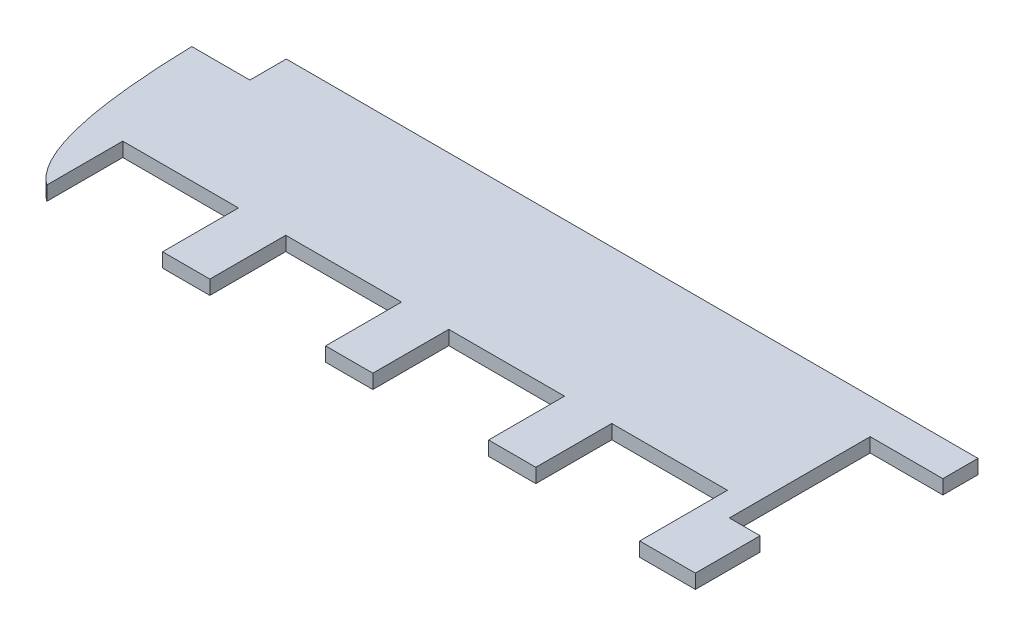
ISO-10303-21;
HEADER;
FILE_DESCRIPTION(('STEP AP214'),'2;1');
FILE_NAME('part.step','',(''),(''),'','','');
FILE_SCHEMA(('AUTOMOTIVE_DESIGN { 1 0 10303 214 1 1 1 1 }'));
ENDSEC;
DATA;
#1=APPLICATION_CONTEXT('core data for automotive mechanical design processes');
#2=APPLICATION_PROTOCOL_DEFINITION('international standard','automotive_design',2000,#1);
#3=PRODUCT_CONTEXT('',#1,'mechanical');
#4=PRODUCT('Part','Part','',(#3));
#5=PRODUCT_RELATED_PRODUCT_CATEGORY('part','',(#4));
#6=PRODUCT_DEFINITION_FORMATION('','',#4);
#7=PRODUCT_DEFINITION_CONTEXT('part definition',#1,'design');
#8=PRODUCT_DEFINITION('design','',#6,#7);
#9=PRODUCT_DEFINITION_SHAPE('','',#8);
#10=(LENGTH_UNIT() NAMED_UNIT(*) SI_UNIT(.MILLI.,.METRE.));
#11=(NAMED_UNIT(*) PLANE_ANGLE_UNIT() SI_UNIT($,.RADIAN.));
#12=(NAMED_UNIT(*) SI_UNIT($,.STERADIAN.) SOLID_ANGLE_UNIT());
#13=UNCERTAINTY_MEASURE_WITH_UNIT(LENGTH_MEASURE(1.E-05),#10,'distance_accuracy_value','');
#14=(GEOMETRIC_REPRESENTATION_CONTEXT(3) GLOBAL_UNCERTAINTY_ASSIGNED_CONTEXT((#13)) GLOBAL_UNIT_ASSIGNED_CONTEXT((#10,
#11,#12)) REPRESENTATION_CONTEXT('',''));
#15=CARTESIAN_POINT('',(0.,0.,0.));
#16=DIRECTION('',(0.,0.,1.));
#17=DIRECTION('',(1.,0.,0.));
#18=AXIS2_PLACEMENT_3D('',#15,#16,#17);
#19=CARTESIAN_POINT('',(-23.2479108635098,1.6,-15.8012256267409));
#20=DIRECTION('',(1.,0.,0.));
#21=DIRECTION('',(0.,0.,-1.));
#22=AXIS2_PLACEMENT_3D('',#19,#20,#21);
#23=PLANE('',#22);
#24=DIRECTION('',(0.,0.,1.));
#25=VECTOR('',#24,1.);
#26=CARTESIAN_POINT('',(-23.2479108635098,0.,-15.8012256267409));
#27=LINE('',#26,#25);
#28=CARTESIAN_POINT('',(-23.2479108635098,0.,-15.8012256267409));
#29=VERTEX_POINT('',#28);
#30=CARTESIAN_POINT('',(-23.2479108635097,0.,-11.6912256267409));
#31=VERTEX_POINT('',#30);
#32=EDGE_CURVE('E231',#29,#31,#27,.T.);
#33=ORIENTED_EDGE('',*,*,#32,.T.);
#34=DIRECTION('',(0.,-1.,0.));
#35=VECTOR('',#34,1.);
#36=CARTESIAN_POINT('',(-23.2479108635097,1.6,-11.6912256267409));
#37=LINE('',#36,#35);
#38=CARTESIAN_POINT('',(-23.2479108635097,1.6,-11.6912256267409));
#39=VERTEX_POINT('',#38);
#40=EDGE_CURVE('E11',#39,#31,#37,.T.);
#41=ORIENTED_EDGE('',*,*,#40,.F.);
#42=DIRECTION('',(0.,0.,1.));
#43=VECTOR('',#42,1.);
#44=CARTESIAN_POINT('',(-23.2479108635098,1.6,-15.8012256267409));
#45=LINE('',#44,#43);
#46=CARTESIAN_POINT('',(-23.2479108635098,1.6,-15.8012256267409));
#47=VERTEX_POINT('',#46);
#48=EDGE_CURVE('E284',#47,#39,#45,.T.);
#49=ORIENTED_EDGE('',*,*,#48,.F.);
#50=DIRECTION('',(0.,-1.,0.));
#51=VECTOR('',#50,1.);
#52=CARTESIAN_POINT('',(-23.2479108635098,1.6,-15.8012256267409));
#53=LINE('',#52,#51);
#54=EDGE_CURVE('E227',#47,#29,#53,.T.);
#55=ORIENTED_EDGE('',*,*,#54,.T.);
#56=EDGE_LOOP('',(#33,#41,#49,#55));
#57=FACE_BOUND('',#56,.T.);
#58=ADVANCED_FACE('F33',(#57),#23,.F.);
#59=CARTESIAN_POINT('',(-23.2479108635097,1.6,-11.6912256267409));
#60=DIRECTION('',(0.,0.,1.));
#61=DIRECTION('',(1.,0.,0.));
#62=AXIS2_PLACEMENT_3D('',#59,#60,#61);
#63=PLANE('',#62);
#64=DIRECTION('',(-1.,0.,0.));
#65=VECTOR('',#64,1.);
#66=CARTESIAN_POINT('',(-23.2479108635097,0.,-11.6912256267409));
#67=LINE('',#66,#65);
#68=CARTESIAN_POINT('',(-29.7979108635098,0.,-11.691225626741));
#69=VERTEX_POINT('',#68);
#70=EDGE_CURVE('E234',#31,#69,#67,.T.);
#71=ORIENTED_EDGE('',*,*,#70,.T.);
#72=DIRECTION('',(0.,-1.,0.));
#73=VECTOR('',#72,1.);
#74=CARTESIAN_POINT('',(-29.7979108635098,1.6,-11.691225626741));
#75=LINE('',#74,#73);
#76=CARTESIAN_POINT('',(-29.7979108635098,1.6,-11.691225626741));
#77=VERTEX_POINT('',#76);
#78=EDGE_CURVE('E41',#77,#69,#75,.T.);
#79=ORIENTED_EDGE('',*,*,#78,.F.);
#80=DIRECTION('',(-1.,0.,0.));
#81=VECTOR('',#80,1.);
#82=CARTESIAN_POINT('',(-23.2479108635097,1.6,-11.6912256267409));
#83=LINE('',#82,#81);
#84=EDGE_CURVE('E143',#39,#77,#83,.T.);
#85=ORIENTED_EDGE('',*,*,#84,.F.);
#86=ORIENTED_EDGE('',*,*,#40,.T.);
#87=EDGE_LOOP('',(#71,#79,#85,#86));
#88=FACE_BOUND('',#87,.T.);
#89=ADVANCED_FACE('F427',(#88),#63,.F.);
#90=CARTESIAN_POINT('',(-29.7979108635098,1.6,-11.691225626741));
#91=CARTESIAN_POINT('',(-29.3411218579026,1.6,6.5185590792816));
#92=CARTESIAN_POINT('',(-24.4479108635098,1.6,9.99877437325944));
#93=B_SPLINE_CURVE_WITH_KNOTS('',2,(#90,#91,#92),.UNSPECIFIED.,.F.,.F.,(3,3),(0.,1.),.UNSPECIFIED.);
#94=DIRECTION('',(0.,-1.,0.));
#95=VECTOR('',#94,1.);
#96=SURFACE_OF_LINEAR_EXTRUSION('',#93,#95);
#97=CARTESIAN_POINT('',(-29.7979108635098,0.,-11.691225626741));
#98=CARTESIAN_POINT('',(-29.3411218579026,0.,6.5185590792816));
#99=CARTESIAN_POINT('',(-24.4479108635098,0.,9.99877437325944));
#100=B_SPLINE_CURVE_WITH_KNOTS('',2,(#97,#98,#99),.UNSPECIFIED.,.F.,.F.,(3,3),(0.,1.),.UNSPECIFIED.);
#101=CARTESIAN_POINT('',(-24.4479108635098,0.,9.99877437325944));
#102=VERTEX_POINT('',#101);
#103=EDGE_CURVE('E236',#69,#102,#100,.T.);
#104=ORIENTED_EDGE('',*,*,#103,.T.);
#105=DIRECTION('',(0.,-1.,0.));
#106=VECTOR('',#105,1.);
#107=CARTESIAN_POINT('',(-24.4479108635098,1.6,9.99877437325944));
#108=LINE('',#107,#106);
#109=CARTESIAN_POINT('',(-24.4479108635098,1.6,9.99877437325944));
#110=VERTEX_POINT('',#109);
#111=EDGE_CURVE('E342',#110,#102,#108,.T.);
#112=ORIENTED_EDGE('',*,*,#111,.F.);
#113=EDGE_CURVE('E350',#77,#110,#93,.T.);
#114=ORIENTED_EDGE('',*,*,#113,.F.);
#115=ORIENTED_EDGE('',*,*,#78,.T.);
#116=EDGE_LOOP('',(#104,#112,#114,#115));
#117=FACE_BOUND('',#116,.T.);
#118=ADVANCED_FACE('F348',(#117),#96,.F.);
#119=CARTESIAN_POINT('',(-24.4479108635098,1.6,1.43877437325944));
#120=DIRECTION('',(-1.,0.,0.));
#121=DIRECTION('',(0.,0.,1.));
#122=AXIS2_PLACEMENT_3D('',#119,#120,#121);
#123=PLANE('',#122);
#124=DIRECTION('',(0.,0.,-1.));
#125=VECTOR('',#124,1.);
#126=CARTESIAN_POINT('',(-24.4479108635098,0.,1.43877437325944));
#127=LINE('',#126,#125);
#128=CARTESIAN_POINT('',(-24.4479108635098,0.,1.43877437325944));
#129=VERTEX_POINT('',#128);
#130=EDGE_CURVE('E240',#102,#129,#127,.T.);
#131=ORIENTED_EDGE('',*,*,#130,.T.);
#132=DIRECTION('',(0.,-1.,0.));
#133=VECTOR('',#132,1.);
#134=CARTESIAN_POINT('',(-24.4479108635098,1.6,1.43877437325944));
#135=LINE('',#134,#133);
#136=CARTESIAN_POINT('',(-24.4479108635098,1.6,1.43877437325944));
#137=VERTEX_POINT('',#136);
#138=EDGE_CURVE('E339',#137,#129,#135,.T.);
#139=ORIENTED_EDGE('',*,*,#138,.F.);
#140=DIRECTION('',(0.,0.,-1.));
#141=VECTOR('',#140,1.);
#142=CARTESIAN_POINT('',(-24.4479108635098,1.6,1.43877437325944));
#143=LINE('',#142,#141);
#144=EDGE_CURVE('E368',#110,#137,#143,.T.);
#145=ORIENTED_EDGE('',*,*,#144,.F.);
#146=ORIENTED_EDGE('',*,*,#111,.T.);
#147=EDGE_LOOP('',(#131,#139,#145,#146));
#148=FACE_BOUND('',#147,.T.);
#149=ADVANCED_FACE('F359',(#148),#123,.F.);
#150=CARTESIAN_POINT('',(-11.3979108635098,1.6,1.43877437325944));
#151=DIRECTION('',(0.,0.,-1.));
#152=DIRECTION('',(-1.,0.,0.));
#153=AXIS2_PLACEMENT_3D('',#150,#151,#152);
#154=PLANE('',#153);
#155=DIRECTION('',(1.,0.,0.));
#156=VECTOR('',#155,1.);
#157=CARTESIAN_POINT('',(-11.3979108635098,0.,1.43877437325944));
#158=LINE('',#157,#156);
#159=CARTESIAN_POINT('',(-11.3979108635098,0.,1.43877437325944));
#160=VERTEX_POINT('',#159);
#161=EDGE_CURVE('E245',#129,#160,#158,.T.);
#162=ORIENTED_EDGE('',*,*,#161,.T.);
#163=DIRECTION('',(0.,-1.,0.));
#164=VECTOR('',#163,1.);
#165=CARTESIAN_POINT('',(-11.3979108635098,1.6,1.43877437325944));
#166=LINE('',#165,#164);
#167=CARTESIAN_POINT('',(-11.3979108635098,1.6,1.43877437325944));
#168=VERTEX_POINT('',#167);
#169=EDGE_CURVE('E336',#168,#160,#166,.T.);
#170=ORIENTED_EDGE('',*,*,#169,.F.);
#171=DIRECTION('',(1.,0.,0.));
#172=VECTOR('',#171,1.);
#173=CARTESIAN_POINT('',(-11.3979108635098,1.6,1.43877437325944));
#174=LINE('',#173,#172);
#175=EDGE_CURVE('E365',#137,#168,#174,.T.);
#176=ORIENTED_EDGE('',*,*,#175,.F.);
#177=ORIENTED_EDGE('',*,*,#138,.T.);
#178=EDGE_LOOP('',(#162,#170,#176,#177));
#179=FACE_BOUND('',#178,.T.);
#180=ADVANCED_FACE('F363',(#179),#154,.F.);
#181=CARTESIAN_POINT('',(-11.3979108635098,1.6,9.99877437325932));
#182=DIRECTION('',(1.,0.,0.));
#183=DIRECTION('',(0.,0.,-1.));
#184=AXIS2_PLACEMENT_3D('',#181,#182,#183);
#185=PLANE('',#184);
#186=DIRECTION('',(0.,0.,1.));
#187=VECTOR('',#186,1.);
#188=CARTESIAN_POINT('',(-11.3979108635098,0.,9.99877437325932));
#189=LINE('',#188,#187);
#190=CARTESIAN_POINT('',(-11.3979108635098,0.,9.99877437325932));
#191=VERTEX_POINT('',#190);
#192=EDGE_CURVE('E247',#160,#191,#189,.T.);
#193=ORIENTED_EDGE('',*,*,#192,.T.);
#194=DIRECTION('',(0.,-1.,0.));
#195=VECTOR('',#194,1.);
#196=CARTESIAN_POINT('',(-11.3979108635098,1.6,9.99877437325932));
#197=LINE('',#196,#195);
#198=CARTESIAN_POINT('',(-11.3979108635098,1.6,9.99877437325932));
#199=VERTEX_POINT('',#198);
#200=EDGE_CURVE('E333',#199,#191,#197,.T.);
#201=ORIENTED_EDGE('',*,*,#200,.F.);
#202=DIRECTION('',(0.,0.,1.));
#203=VECTOR('',#202,1.);
#204=CARTESIAN_POINT('',(-11.3979108635098,1.6,9.99877437325932));
#205=LINE('',#204,#203);
#206=EDGE_CURVE('E367',#168,#199,#205,.T.);
#207=ORIENTED_EDGE('',*,*,#206,.F.);
#208=ORIENTED_EDGE('',*,*,#169,.T.);
#209=EDGE_LOOP('',(#193,#201,#207,#208));
#210=FACE_BOUND('',#209,.T.);
#211=ADVANCED_FACE('F448',(#210),#185,.F.);
#212=CARTESIAN_POINT('',(-6.06791086350975,1.6,9.99877437325932));
#213=DIRECTION('',(0.,0.,-1.));
#214=DIRECTION('',(-1.,0.,0.));
#215=AXIS2_PLACEMENT_3D('',#212,#213,#214);
#216=PLANE('',#215);
#217=DIRECTION('',(1.,0.,0.));
#218=VECTOR('',#217,1.);
#219=CARTESIAN_POINT('',(-6.06791086350975,0.,9.99877437325932));
#220=LINE('',#219,#218);
#221=CARTESIAN_POINT('',(-6.06791086350975,0.,9.99877437325932));
#222=VERTEX_POINT('',#221);
#223=EDGE_CURVE('E249',#191,#222,#220,.T.);
#224=ORIENTED_EDGE('',*,*,#223,.T.);
#225=DIRECTION('',(0.,-1.,0.));
#226=VECTOR('',#225,1.);
#227=CARTESIAN_POINT('',(-6.06791086350975,1.6,9.99877437325932));
#228=LINE('',#227,#226);
#229=CARTESIAN_POINT('',(-6.06791086350975,1.6,9.99877437325932));
#230=VERTEX_POINT('',#229);
#231=EDGE_CURVE('E330',#230,#222,#228,.T.);
#232=ORIENTED_EDGE('',*,*,#231,.F.);
#233=DIRECTION('',(1.,0.,0.));
#234=VECTOR('',#233,1.);
#235=CARTESIAN_POINT('',(-6.06791086350975,1.6,9.99877437325932));
#236=LINE('',#235,#234);
#237=EDGE_CURVE('E370',#199,#230,#236,.T.);
#238=ORIENTED_EDGE('',*,*,#237,.F.);
#239=ORIENTED_EDGE('',*,*,#200,.T.);
#240=EDGE_LOOP('',(#224,#232,#238,#239));
#241=FACE_BOUND('',#240,.T.);
#242=ADVANCED_FACE('F451',(#241),#216,.F.);
#243=CARTESIAN_POINT('',(-6.06791086350975,1.6,1.43877437325932));
#244=DIRECTION('',(-1.,0.,0.));
#245=DIRECTION('',(0.,0.,1.));
#246=AXIS2_PLACEMENT_3D('',#243,#244,#245);
#247=PLANE('',#246);
#248=DIRECTION('',(0.,0.,-1.));
#249=VECTOR('',#248,1.);
#250=CARTESIAN_POINT('',(-6.06791086350975,0.,1.43877437325932));
#251=LINE('',#250,#249);
#252=CARTESIAN_POINT('',(-6.06791086350975,0.,1.43877437325932));
#253=VERTEX_POINT('',#252);
#254=EDGE_CURVE('E251',#222,#253,#251,.T.);
#255=ORIENTED_EDGE('',*,*,#254,.T.);
#256=DIRECTION('',(0.,-1.,0.));
#257=VECTOR('',#256,1.);
#258=CARTESIAN_POINT('',(-6.06791086350975,1.6,1.43877437325932));
#259=LINE('',#258,#257);
#260=CARTESIAN_POINT('',(-6.06791086350975,1.6,1.43877437325932));
#261=VERTEX_POINT('',#260);
#262=EDGE_CURVE('E327',#261,#253,#259,.T.);
#263=ORIENTED_EDGE('',*,*,#262,.F.);
#264=DIRECTION('',(0.,0.,-1.));
#265=VECTOR('',#264,1.);
#266=CARTESIAN_POINT('',(-6.06791086350975,1.6,1.43877437325932));
#267=LINE('',#266,#265);
#268=EDGE_CURVE('E376',#230,#261,#267,.T.);
#269=ORIENTED_EDGE('',*,*,#268,.F.);
#270=ORIENTED_EDGE('',*,*,#231,.T.);
#271=EDGE_LOOP('',(#255,#263,#269,#270));
#272=FACE_BOUND('',#271,.T.);
#273=ADVANCED_FACE('F455',(#272),#247,.F.);
#274=CARTESIAN_POINT('',(6.98208913649025,1.6,1.43877437325931));
#275=DIRECTION('',(0.,0.,-1.));
#276=DIRECTION('',(-1.,0.,0.));
#277=AXIS2_PLACEMENT_3D('',#274,#275,#276);
#278=PLANE('',#277);
#279=DIRECTION('',(1.,0.,0.));
#280=VECTOR('',#279,1.);
#281=CARTESIAN_POINT('',(6.98208913649025,0.,1.43877437325931));
#282=LINE('',#281,#280);
#283=CARTESIAN_POINT('',(6.98208913649025,0.,1.43877437325931));
#284=VERTEX_POINT('',#283);
#285=EDGE_CURVE('E253',#253,#284,#282,.T.);
#286=ORIENTED_EDGE('',*,*,#285,.T.);
#287=DIRECTION('',(0.,-1.,0.));
#288=VECTOR('',#287,1.);
#289=CARTESIAN_POINT('',(6.98208913649025,1.6,1.43877437325931));
#290=LINE('',#289,#288);
#291=CARTESIAN_POINT('',(6.98208913649025,1.6,1.43877437325931));
#292=VERTEX_POINT('',#291);
#293=EDGE_CURVE('E324',#292,#284,#290,.T.);
#294=ORIENTED_EDGE('',*,*,#293,.F.);
#295=DIRECTION('',(1.,0.,0.));
#296=VECTOR('',#295,1.);
#297=CARTESIAN_POINT('',(6.98208913649025,1.6,1.43877437325931));
#298=LINE('',#297,#296);
#299=EDGE_CURVE('E378',#261,#292,#298,.T.);
#300=ORIENTED_EDGE('',*,*,#299,.F.);
#301=ORIENTED_EDGE('',*,*,#262,.T.);
#302=EDGE_LOOP('',(#286,#294,#300,#301));
#303=FACE_BOUND('',#302,.T.);
#304=ADVANCED_FACE('F459',(#303),#278,.F.);
#305=CARTESIAN_POINT('',(6.98208913649025,1.6,9.99877437325919));
#306=DIRECTION('',(1.,0.,0.));
#307=DIRECTION('',(0.,0.,-1.));
#308=AXIS2_PLACEMENT_3D('',#305,#306,#307);
#309=PLANE('',#308);
#310=DIRECTION('',(0.,0.,1.));
#311=VECTOR('',#310,1.);
#312=CARTESIAN_POINT('',(6.98208913649025,0.,9.99877437325919));
#313=LINE('',#312,#311);
#314=CARTESIAN_POINT('',(6.98208913649025,0.,9.99877437325919));
#315=VERTEX_POINT('',#314);
#316=EDGE_CURVE('E255',#284,#315,#313,.T.);
#317=ORIENTED_EDGE('',*,*,#316,.T.);
#318=DIRECTION('',(0.,-1.,0.));
#319=VECTOR('',#318,1.);
#320=CARTESIAN_POINT('',(6.98208913649025,1.6,9.99877437325919));
#321=LINE('',#320,#319);
#322=CARTESIAN_POINT('',(6.98208913649025,1.6,9.99877437325919));
#323=VERTEX_POINT('',#322);
#324=EDGE_CURVE('E321',#323,#315,#321,.T.);
#325=ORIENTED_EDGE('',*,*,#324,.F.);
#326=DIRECTION('',(0.,0.,1.));
#327=VECTOR('',#326,1.);
#328=CARTESIAN_POINT('',(6.98208913649025,1.6,9.99877437325919));
#329=LINE('',#328,#327);
#330=EDGE_CURVE('E380',#292,#323,#329,.T.);
#331=ORIENTED_EDGE('',*,*,#330,.F.);
#332=ORIENTED_EDGE('',*,*,#293,.T.);
#333=EDGE_LOOP('',(#317,#325,#331,#332));
#334=FACE_BOUND('',#333,.T.);
#335=ADVANCED_FACE('F463',(#334),#309,.F.);
#336=CARTESIAN_POINT('',(12.3120891364902,1.6,9.99877437325919));
#337=DIRECTION('',(0.,0.,-1.));
#338=DIRECTION('',(-1.,0.,0.));
#339=AXIS2_PLACEMENT_3D('',#336,#337,#338);
#340=PLANE('',#339);
#341=DIRECTION('',(1.,0.,0.));
#342=VECTOR('',#341,1.);
#343=CARTESIAN_POINT('',(12.3120891364902,0.,9.99877437325919));
#344=LINE('',#343,#342);
#345=CARTESIAN_POINT('',(12.3120891364902,0.,9.99877437325919));
#346=VERTEX_POINT('',#345);
#347=EDGE_CURVE('E257',#315,#346,#344,.T.);
#348=ORIENTED_EDGE('',*,*,#347,.T.);
#349=DIRECTION('',(0.,-1.,0.));
#350=VECTOR('',#349,1.);
#351=CARTESIAN_POINT('',(12.3120891364902,1.6,9.99877437325919));
#352=LINE('',#351,#350);
#353=CARTESIAN_POINT('',(12.3120891364902,1.6,9.99877437325919));
#354=VERTEX_POINT('',#353);
#355=EDGE_CURVE('E318',#354,#346,#352,.T.);
#356=ORIENTED_EDGE('',*,*,#355,.F.);
#357=DIRECTION('',(1.,0.,0.));
#358=VECTOR('',#357,1.);
#359=CARTESIAN_POINT('',(12.3120891364902,1.6,9.99877437325919));
#360=LINE('',#359,#358);
#361=EDGE_CURVE('E382',#323,#354,#360,.T.);
#362=ORIENTED_EDGE('',*,*,#361,.F.);
#363=ORIENTED_EDGE('',*,*,#324,.T.);
#364=EDGE_LOOP('',(#348,#356,#362,#363));
#365=FACE_BOUND('',#364,.T.);
#366=ADVANCED_FACE('F467',(#365),#340,.F.);
#367=CARTESIAN_POINT('',(12.3120891364902,1.6,1.43877437325919));
#368=DIRECTION('',(-1.,0.,0.));
#369=DIRECTION('',(0.,0.,1.));
#370=AXIS2_PLACEMENT_3D('',#367,#368,#369);
#371=PLANE('',#370);
#372=DIRECTION('',(0.,0.,-1.));
#373=VECTOR('',#372,1.);
#374=CARTESIAN_POINT('',(12.3120891364902,0.,1.43877437325919));
#375=LINE('',#374,#373);
#376=CARTESIAN_POINT('',(12.3120891364902,0.,1.43877437325919));
#377=VERTEX_POINT('',#376);
#378=EDGE_CURVE('E259',#346,#377,#375,.T.);
#379=ORIENTED_EDGE('',*,*,#378,.T.);
#380=DIRECTION('',(0.,-1.,0.));
#381=VECTOR('',#380,1.);
#382=CARTESIAN_POINT('',(12.3120891364902,1.6,1.43877437325919));
#383=LINE('',#382,#381);
#384=CARTESIAN_POINT('',(12.3120891364902,1.6,1.43877437325919));
#385=VERTEX_POINT('',#384);
#386=EDGE_CURVE('E315',#385,#377,#383,.T.);
#387=ORIENTED_EDGE('',*,*,#386,.F.);
#388=DIRECTION('',(0.,0.,-1.));
#389=VECTOR('',#388,1.);
#390=CARTESIAN_POINT('',(12.3120891364902,1.6,1.43877437325919));
#391=LINE('',#390,#389);
#392=EDGE_CURVE('E384',#354,#385,#391,.T.);
#393=ORIENTED_EDGE('',*,*,#392,.F.);
#394=ORIENTED_EDGE('',*,*,#355,.T.);
#395=EDGE_LOOP('',(#379,#387,#393,#394));
#396=FACE_BOUND('',#395,.T.);
#397=ADVANCED_FACE('F471',(#396),#371,.F.);
#398=CARTESIAN_POINT('',(25.3620891364902,1.6,1.43877437325919));
#399=DIRECTION('',(0.,0.,-1.));
#400=DIRECTION('',(-1.,0.,0.));
#401=AXIS2_PLACEMENT_3D('',#398,#399,#400);
#402=PLANE('',#401);
#403=DIRECTION('',(1.,0.,0.));
#404=VECTOR('',#403,1.);
#405=CARTESIAN_POINT('',(25.3620891364902,0.,1.43877437325919));
#406=LINE('',#405,#404);
#407=CARTESIAN_POINT('',(25.3620891364902,0.,1.43877437325919));
#408=VERTEX_POINT('',#407);
#409=EDGE_CURVE('E261',#377,#408,#406,.T.);
#410=ORIENTED_EDGE('',*,*,#409,.T.);
#411=DIRECTION('',(0.,-1.,0.));
#412=VECTOR('',#411,1.);
#413=CARTESIAN_POINT('',(25.3620891364902,1.6,1.43877437325919));
#414=LINE('',#413,#412);
#415=CARTESIAN_POINT('',(25.3620891364902,1.6,1.43877437325919));
#416=VERTEX_POINT('',#415);
#417=EDGE_CURVE('E312',#416,#408,#414,.T.);
#418=ORIENTED_EDGE('',*,*,#417,.F.);
#419=DIRECTION('',(1.,0.,0.));
#420=VECTOR('',#419,1.);
#421=CARTESIAN_POINT('',(25.3620891364902,1.6,1.43877437325919));
#422=LINE('',#421,#420);
#423=EDGE_CURVE('E386',#385,#416,#422,.T.);
#424=ORIENTED_EDGE('',*,*,#423,.F.);
#425=ORIENTED_EDGE('',*,*,#386,.T.);
#426=EDGE_LOOP('',(#410,#418,#424,#425));
#427=FACE_BOUND('',#426,.T.);
#428=ADVANCED_FACE('F475',(#427),#402,.F.);
#429=CARTESIAN_POINT('',(25.3620891364902,1.6,9.99877437325906));
#430=DIRECTION('',(1.,0.,0.));
#431=DIRECTION('',(0.,0.,-1.));
#432=AXIS2_PLACEMENT_3D('',#429,#430,#431);
#433=PLANE('',#432);
#434=DIRECTION('',(0.,0.,1.));
#435=VECTOR('',#434,1.);
#436=CARTESIAN_POINT('',(25.3620891364902,0.,9.99877437325906));
#437=LINE('',#436,#435);
#438=CARTESIAN_POINT('',(25.3620891364902,0.,9.99877437325906));
#439=VERTEX_POINT('',#438);
#440=EDGE_CURVE('E263',#408,#439,#437,.T.);
#441=ORIENTED_EDGE('',*,*,#440,.T.);
#442=DIRECTION('',(0.,-1.,0.));
#443=VECTOR('',#442,1.);
#444=CARTESIAN_POINT('',(25.3620891364902,1.6,9.99877437325906));
#445=LINE('',#444,#443);
#446=CARTESIAN_POINT('',(25.3620891364902,1.6,9.99877437325906));
#447=VERTEX_POINT('',#446);
#448=EDGE_CURVE('E309',#447,#439,#445,.T.);
#449=ORIENTED_EDGE('',*,*,#448,.F.);
#450=DIRECTION('',(0.,0.,1.));
#451=VECTOR('',#450,1.);
#452=CARTESIAN_POINT('',(25.3620891364902,1.6,9.99877437325906));
#453=LINE('',#452,#451);
#454=EDGE_CURVE('E388',#416,#447,#453,.T.);
#455=ORIENTED_EDGE('',*,*,#454,.F.);
#456=ORIENTED_EDGE('',*,*,#417,.T.);
#457=EDGE_LOOP('',(#441,#449,#455,#456));
#458=FACE_BOUND('',#457,.T.);
#459=ADVANCED_FACE('F479',(#458),#433,.F.);
#460=CARTESIAN_POINT('',(30.6920891364902,1.6,9.99877437325906));
#461=DIRECTION('',(0.,0.,-1.));
#462=DIRECTION('',(-1.,0.,0.));
#463=AXIS2_PLACEMENT_3D('',#460,#461,#462);
#464=PLANE('',#463);
#465=DIRECTION('',(1.,0.,0.));
#466=VECTOR('',#465,1.);
#467=CARTESIAN_POINT('',(30.6920891364902,0.,9.99877437325906));
#468=LINE('',#467,#466);
#469=CARTESIAN_POINT('',(30.6920891364902,0.,9.99877437325906));
#470=VERTEX_POINT('',#469);
#471=EDGE_CURVE('E265',#439,#470,#468,.T.);
#472=ORIENTED_EDGE('',*,*,#471,.T.);
#473=DIRECTION('',(0.,-1.,0.));
#474=VECTOR('',#473,1.);
#475=CARTESIAN_POINT('',(30.6920891364902,1.6,9.99877437325906));
#476=LINE('',#475,#474);
#477=CARTESIAN_POINT('',(30.6920891364902,1.6,9.99877437325906));
#478=VERTEX_POINT('',#477);
#479=EDGE_CURVE('E306',#478,#470,#476,.T.);
#480=ORIENTED_EDGE('',*,*,#479,.F.);
#481=DIRECTION('',(1.,0.,0.));
#482=VECTOR('',#481,1.);
#483=CARTESIAN_POINT('',(30.6920891364902,1.6,9.99877437325906));
#484=LINE('',#483,#482);
#485=EDGE_CURVE('E390',#447,#478,#484,.T.);
#486=ORIENTED_EDGE('',*,*,#485,.F.);
#487=ORIENTED_EDGE('',*,*,#448,.T.);
#488=EDGE_LOOP('',(#472,#480,#486,#487));
#489=FACE_BOUND('',#488,.T.);
#490=ADVANCED_FACE('F483',(#489),#464,.F.);
#491=CARTESIAN_POINT('',(30.6920891364902,1.6,1.43877437325906));
#492=DIRECTION('',(-1.,0.,0.));
#493=DIRECTION('',(0.,0.,1.));
#494=AXIS2_PLACEMENT_3D('',#491,#492,#493);
#495=PLANE('',#494);
#496=DIRECTION('',(0.,0.,-1.));
#497=VECTOR('',#496,1.);
#498=CARTESIAN_POINT('',(30.6920891364902,0.,1.43877437325906));
#499=LINE('',#498,#497);
#500=CARTESIAN_POINT('',(30.6920891364902,0.,1.43877437325906));
#501=VERTEX_POINT('',#500);
#502=EDGE_CURVE('E267',#470,#501,#499,.T.);
#503=ORIENTED_EDGE('',*,*,#502,.T.);
#504=DIRECTION('',(0.,-1.,0.));
#505=VECTOR('',#504,1.);
#506=CARTESIAN_POINT('',(30.6920891364902,1.6,1.43877437325906));
#507=LINE('',#506,#505);
#508=CARTESIAN_POINT('',(30.6920891364902,1.6,1.43877437325906));
#509=VERTEX_POINT('',#508);
#510=EDGE_CURVE('E303',#509,#501,#507,.T.);
#511=ORIENTED_EDGE('',*,*,#510,.F.);
#512=DIRECTION('',(0.,0.,-1.));
#513=VECTOR('',#512,1.);
#514=CARTESIAN_POINT('',(30.6920891364902,1.6,1.43877437325906));
#515=LINE('',#514,#513);
#516=EDGE_CURVE('E392',#478,#509,#515,.T.);
#517=ORIENTED_EDGE('',*,*,#516,.F.);
#518=ORIENTED_EDGE('',*,*,#479,.T.);
#519=EDGE_LOOP('',(#503,#511,#517,#518));
#520=FACE_BOUND('',#519,.T.);
#521=ADVANCED_FACE('F487',(#520),#495,.F.);
#522=CARTESIAN_POINT('',(43.7420891364903,1.6,1.43877437325906));
#523=DIRECTION('',(0.,0.,-1.));
#524=DIRECTION('',(-1.,0.,0.));
#525=AXIS2_PLACEMENT_3D('',#522,#523,#524);
#526=PLANE('',#525);
#527=DIRECTION('',(1.,0.,0.));
#528=VECTOR('',#527,1.);
#529=CARTESIAN_POINT('',(43.7420891364903,0.,1.43877437325906));
#530=LINE('',#529,#528);
#531=CARTESIAN_POINT('',(43.7420891364903,0.,1.43877437325906));
#532=VERTEX_POINT('',#531);
#533=EDGE_CURVE('E269',#501,#532,#530,.T.);
#534=ORIENTED_EDGE('',*,*,#533,.T.);
#535=DIRECTION('',(0.,-1.,0.));
#536=VECTOR('',#535,1.);
#537=CARTESIAN_POINT('',(43.7420891364903,1.6,1.43877437325906));
#538=LINE('',#537,#536);
#539=CARTESIAN_POINT('',(43.7420891364903,1.6,1.43877437325906));
#540=VERTEX_POINT('',#539);
#541=EDGE_CURVE('E300',#540,#532,#538,.T.);
#542=ORIENTED_EDGE('',*,*,#541,.F.);
#543=DIRECTION('',(1.,0.,0.));
#544=VECTOR('',#543,1.);
#545=CARTESIAN_POINT('',(43.7420891364903,1.6,1.43877437325906));
#546=LINE('',#545,#544);
#547=EDGE_CURVE('E394',#509,#540,#546,.T.);
#548=ORIENTED_EDGE('',*,*,#547,.F.);
#549=ORIENTED_EDGE('',*,*,#510,.T.);
#550=EDGE_LOOP('',(#534,#542,#548,#549));
#551=FACE_BOUND('',#550,.T.);
#552=ADVANCED_FACE('F491',(#551),#526,.F.);
#553=CARTESIAN_POINT('',(43.7420891364903,1.6,11.3387743732591));
#554=DIRECTION('',(1.,0.,0.));
#555=DIRECTION('',(0.,0.,-1.));
#556=AXIS2_PLACEMENT_3D('',#553,#554,#555);
#557=PLANE('',#556);
#558=DIRECTION('',(0.,0.,1.));
#559=VECTOR('',#558,1.);
#560=CARTESIAN_POINT('',(43.7420891364903,0.,11.3387743732591));
#561=LINE('',#560,#559);
#562=CARTESIAN_POINT('',(43.7420891364903,0.,11.3387743732591));
#563=VERTEX_POINT('',#562);
#564=EDGE_CURVE('E271',#532,#563,#561,.T.);
#565=ORIENTED_EDGE('',*,*,#564,.T.);
#566=DIRECTION('',(0.,-1.,0.));
#567=VECTOR('',#566,1.);
#568=CARTESIAN_POINT('',(43.7420891364903,1.6,11.3387743732591));
#569=LINE('',#568,#567);
#570=CARTESIAN_POINT('',(43.7420891364903,1.6,11.3387743732591));
#571=VERTEX_POINT('',#570);
#572=EDGE_CURVE('E297',#571,#563,#569,.T.);
#573=ORIENTED_EDGE('',*,*,#572,.F.);
#574=DIRECTION('',(0.,0.,1.));
#575=VECTOR('',#574,1.);
#576=CARTESIAN_POINT('',(43.7420891364903,1.6,11.3387743732591));
#577=LINE('',#576,#575);
#578=EDGE_CURVE('E396',#540,#571,#577,.T.);
#579=ORIENTED_EDGE('',*,*,#578,.F.);
#580=ORIENTED_EDGE('',*,*,#541,.T.);
#581=EDGE_LOOP('',(#565,#573,#579,#580));
#582=FACE_BOUND('',#581,.T.);
#583=ADVANCED_FACE('F495',(#582),#557,.F.);
#584=CARTESIAN_POINT('',(50.0220891364903,1.6,11.3387743732591));
#585=DIRECTION('',(0.,0.,-1.));
#586=DIRECTION('',(-1.,0.,0.));
#587=AXIS2_PLACEMENT_3D('',#584,#585,#586);
#588=PLANE('',#587);
#589=DIRECTION('',(1.,0.,0.));
#590=VECTOR('',#589,1.);
#591=CARTESIAN_POINT('',(50.0220891364903,0.,11.3387743732591));
#592=LINE('',#591,#590);
#593=CARTESIAN_POINT('',(50.0220891364903,0.,11.3387743732591));
#594=VERTEX_POINT('',#593);
#595=EDGE_CURVE('E273',#563,#594,#592,.T.);
#596=ORIENTED_EDGE('',*,*,#595,.T.);
#597=DIRECTION('',(0.,-1.,0.));
#598=VECTOR('',#597,1.);
#599=CARTESIAN_POINT('',(50.0220891364903,1.6,11.3387743732591));
#600=LINE('',#599,#598);
#601=CARTESIAN_POINT('',(50.0220891364903,1.6,11.3387743732591));
#602=VERTEX_POINT('',#601);
#603=EDGE_CURVE('E294',#602,#594,#600,.T.);
#604=ORIENTED_EDGE('',*,*,#603,.F.);
#605=DIRECTION('',(1.,0.,0.));
#606=VECTOR('',#605,1.);
#607=CARTESIAN_POINT('',(50.0220891364903,1.6,11.3387743732591));
#608=LINE('',#607,#606);
#609=EDGE_CURVE('E398',#571,#602,#608,.T.);
#610=ORIENTED_EDGE('',*,*,#609,.F.);
#611=ORIENTED_EDGE('',*,*,#572,.T.);
#612=EDGE_LOOP('',(#596,#604,#610,#611));
#613=FACE_BOUND('',#612,.T.);
#614=ADVANCED_FACE('F499',(#613),#588,.F.);
#615=CARTESIAN_POINT('',(50.0220891364903,1.6,4.03877437325906));
#616=DIRECTION('',(-1.,0.,0.));
#617=DIRECTION('',(0.,0.,1.));
#618=AXIS2_PLACEMENT_3D('',#615,#616,#617);
#619=PLANE('',#618);
#620=DIRECTION('',(0.,0.,-1.));
#621=VECTOR('',#620,1.);
#622=CARTESIAN_POINT('',(50.0220891364903,0.,4.03877437325906));
#623=LINE('',#622,#621);
#624=CARTESIAN_POINT('',(50.0220891364903,0.,4.03877437325906));
#625=VERTEX_POINT('',#624);
#626=EDGE_CURVE('E275',#594,#625,#623,.T.);
#627=ORIENTED_EDGE('',*,*,#626,.T.);
#628=DIRECTION('',(0.,-1.,0.));
#629=VECTOR('',#628,1.);
#630=CARTESIAN_POINT('',(50.0220891364903,1.6,4.03877437325906));
#631=LINE('',#630,#629);
#632=CARTESIAN_POINT('',(50.0220891364903,1.6,4.03877437325906));
#633=VERTEX_POINT('',#632);
#634=EDGE_CURVE('E291',#633,#625,#631,.T.);
#635=ORIENTED_EDGE('',*,*,#634,.F.);
#636=DIRECTION('',(0.,0.,-1.));
#637=VECTOR('',#636,1.);
#638=CARTESIAN_POINT('',(50.0220891364903,1.6,4.03877437325906));
#639=LINE('',#638,#637);
#640=EDGE_CURVE('E400',#602,#633,#639,.T.);
#641=ORIENTED_EDGE('',*,*,#640,.F.);
#642=ORIENTED_EDGE('',*,*,#603,.T.);
#643=EDGE_LOOP('',(#627,#635,#641,#642));
#644=FACE_BOUND('',#643,.T.);
#645=ADVANCED_FACE('F503',(#644),#619,.F.);
#646=CARTESIAN_POINT('',(46.5520891364902,1.6,4.03877437325906));
#647=DIRECTION('',(0.,0.,1.));
#648=DIRECTION('',(1.,0.,0.));
#649=AXIS2_PLACEMENT_3D('',#646,#647,#648);
#650=PLANE('',#649);
#651=DIRECTION('',(-1.,0.,0.));
#652=VECTOR('',#651,1.);
#653=CARTESIAN_POINT('',(46.5520891364902,0.,4.03877437325906));
#654=LINE('',#653,#652);
#655=CARTESIAN_POINT('',(46.5520891364902,0.,4.03877437325906));
#656=VERTEX_POINT('',#655);
#657=EDGE_CURVE('E277',#625,#656,#654,.T.);
#658=ORIENTED_EDGE('',*,*,#657,.T.);
#659=DIRECTION('',(0.,-1.,0.));
#660=VECTOR('',#659,1.);
#661=CARTESIAN_POINT('',(46.5520891364902,1.6,4.03877437325906));
#662=LINE('',#661,#660);
#663=CARTESIAN_POINT('',(46.5520891364902,1.6,4.03877437325906));
#664=VERTEX_POINT('',#663);
#665=EDGE_CURVE('E288',#664,#656,#662,.T.);
#666=ORIENTED_EDGE('',*,*,#665,.F.);
#667=DIRECTION('',(-1.,0.,0.));
#668=VECTOR('',#667,1.);
#669=CARTESIAN_POINT('',(46.5520891364902,1.6,4.03877437325906));
#670=LINE('',#669,#668);
#671=EDGE_CURVE('E402',#633,#664,#670,.T.);
#672=ORIENTED_EDGE('',*,*,#671,.F.);
#673=ORIENTED_EDGE('',*,*,#634,.T.);
#674=EDGE_LOOP('',(#658,#666,#672,#673));
#675=FACE_BOUND('',#674,.T.);
#676=ADVANCED_FACE('F408',(#675),#650,.F.);
#677=CARTESIAN_POINT('',(46.5520891364902,1.6,-11.8412256267409));
#678=DIRECTION('',(-1.,0.,0.));
#679=DIRECTION('',(0.,0.,1.));
#680=AXIS2_PLACEMENT_3D('',#677,#678,#679);
#681=PLANE('',#680);
#682=DIRECTION('',(0.,0.,-1.));
#683=VECTOR('',#682,1.);
#684=CARTESIAN_POINT('',(46.5520891364902,0.,-11.8412256267409));
#685=LINE('',#684,#683);
#686=CARTESIAN_POINT('',(46.5520891364902,0.,-11.8412256267409));
#687=VERTEX_POINT('',#686);
#688=EDGE_CURVE('E279',#656,#687,#685,.T.);
#689=ORIENTED_EDGE('',*,*,#688,.T.);
#690=DIRECTION('',(0.,-1.,0.));
#691=VECTOR('',#690,1.);
#692=CARTESIAN_POINT('',(46.5520891364902,1.6,-11.8412256267409));
#693=LINE('',#692,#691);
#694=CARTESIAN_POINT('',(46.5520891364902,1.6,-11.8412256267409));
#695=VERTEX_POINT('',#694);
#696=EDGE_CURVE('E222',#695,#687,#693,.T.);
#697=ORIENTED_EDGE('',*,*,#696,.F.);
#698=DIRECTION('',(0.,0.,-1.));
#699=VECTOR('',#698,1.);
#700=CARTESIAN_POINT('',(46.5520891364902,1.6,-11.8412256267409));
#701=LINE('',#700,#699);
#702=EDGE_CURVE('E213',#664,#695,#701,.T.);
#703=ORIENTED_EDGE('',*,*,#702,.F.);
#704=ORIENTED_EDGE('',*,*,#665,.T.);
#705=EDGE_LOOP('',(#689,#697,#703,#704));
#706=FACE_BOUND('',#705,.T.);
#707=ADVANCED_FACE('F412',(#706),#681,.F.);
#708=CARTESIAN_POINT('',(54.7520891364902,1.6,-11.8412256267409));
#709=DIRECTION('',(0.,0.,-1.));
#710=DIRECTION('',(-1.,0.,0.));
#711=AXIS2_PLACEMENT_3D('',#708,#709,#710);
#712=PLANE('',#711);
#713=DIRECTION('',(1.,0.,0.));
#714=VECTOR('',#713,1.);
#715=CARTESIAN_POINT('',(54.7520891364902,0.,-11.8412256267409));
#716=LINE('',#715,#714);
#717=CARTESIAN_POINT('',(54.7520891364902,0.,-11.8412256267409));
#718=VERTEX_POINT('',#717);
#719=EDGE_CURVE('E221',#687,#718,#716,.T.);
#720=ORIENTED_EDGE('',*,*,#719,.T.);
#721=DIRECTION('',(0.,-1.,0.));
#722=VECTOR('',#721,1.);
#723=CARTESIAN_POINT('',(54.7520891364902,1.6,-11.8412256267409));
#724=LINE('',#723,#722);
#725=CARTESIAN_POINT('',(54.7520891364902,1.6,-11.8412256267409));
#726=VERTEX_POINT('',#725);
#727=EDGE_CURVE('E218',#726,#718,#724,.T.);
#728=ORIENTED_EDGE('',*,*,#727,.F.);
#729=DIRECTION('',(1.,0.,0.));
#730=VECTOR('',#729,1.);
#731=CARTESIAN_POINT('',(54.7520891364902,1.6,-11.8412256267409));
#732=LINE('',#731,#730);
#733=EDGE_CURVE('E207',#695,#726,#732,.T.);
#734=ORIENTED_EDGE('',*,*,#733,.F.);
#735=ORIENTED_EDGE('',*,*,#696,.T.);
#736=EDGE_LOOP('',(#720,#728,#734,#735));
#737=FACE_BOUND('',#736,.T.);
#738=ADVANCED_FACE('F219',(#737),#712,.F.);
#739=CARTESIAN_POINT('',(54.7520891364902,1.6,-15.8012256267409));
#740=DIRECTION('',(-1.,0.,0.));
#741=DIRECTION('',(0.,0.,1.));
#742=AXIS2_PLACEMENT_3D('',#739,#740,#741);
#743=PLANE('',#742);
#744=DIRECTION('',(0.,0.,-1.));
#745=VECTOR('',#744,1.);
#746=CARTESIAN_POINT('',(54.7520891364902,0.,-15.8012256267409));
#747=LINE('',#746,#745);
#748=CARTESIAN_POINT('',(54.7520891364902,0.,-15.8012256267409));
#749=VERTEX_POINT('',#748);
#750=EDGE_CURVE('E129',#718,#749,#747,.T.);
#751=ORIENTED_EDGE('',*,*,#750,.T.);
#752=DIRECTION('',(0.,-1.,0.));
#753=VECTOR('',#752,1.);
#754=CARTESIAN_POINT('',(54.7520891364902,1.6,-15.8012256267409));
#755=LINE('',#754,#753);
#756=CARTESIAN_POINT('',(54.7520891364902,1.6,-15.8012256267409));
#757=VERTEX_POINT('',#756);
#758=EDGE_CURVE('E223',#757,#749,#755,.T.);
#759=ORIENTED_EDGE('',*,*,#758,.F.);
#760=DIRECTION('',(0.,0.,-1.));
#761=VECTOR('',#760,1.);
#762=CARTESIAN_POINT('',(54.7520891364902,1.6,-15.8012256267409));
#763=LINE('',#762,#761);
#764=EDGE_CURVE('E211',#726,#757,#763,.T.);
#765=ORIENTED_EDGE('',*,*,#764,.F.);
#766=ORIENTED_EDGE('',*,*,#727,.T.);
#767=EDGE_LOOP('',(#751,#759,#765,#766));
#768=FACE_BOUND('',#767,.T.);
#769=ADVANCED_FACE('F225',(#768),#743,.F.);
#770=CARTESIAN_POINT('',(-23.2479108635098,1.6,-15.8012256267409));
#771=DIRECTION('',(0.,0.,1.));
#772=DIRECTION('',(1.,0.,0.));
#773=AXIS2_PLACEMENT_3D('',#770,#771,#772);
#774=PLANE('',#773);
#775=DIRECTION('',(-1.,0.,0.));
#776=VECTOR('',#775,1.);
#777=CARTESIAN_POINT('',(-23.2479108635098,0.,-15.8012256267409));
#778=LINE('',#777,#776);
#779=EDGE_CURVE('E135',#749,#29,#778,.T.);
#780=ORIENTED_EDGE('',*,*,#779,.T.);
#781=ORIENTED_EDGE('',*,*,#54,.F.);
#782=DIRECTION('',(-1.,0.,0.));
#783=VECTOR('',#782,1.);
#784=CARTESIAN_POINT('',(-23.2479108635098,1.6,-15.8012256267409));
#785=LINE('',#784,#783);
#786=EDGE_CURVE('E49',#757,#47,#785,.T.);
#787=ORIENTED_EDGE('',*,*,#786,.F.);
#788=ORIENTED_EDGE('',*,*,#758,.T.);
#789=EDGE_LOOP('',(#780,#781,#787,#788));
#790=FACE_BOUND('',#789,.T.);
#791=ADVANCED_FACE('F416',(#790),#774,.F.);
#792=CARTESIAN_POINT('',(-28.2320163607062,1.6,2.83616672627042));
#793=DIRECTION('',(0.,1.,0.));
#794=DIRECTION('',(0.,0.,1.));
#795=AXIS2_PLACEMENT_3D('',#792,#793,#794);
#796=PLANE('',#795);
#797=ORIENTED_EDGE('',*,*,#48,.T.);
#798=ORIENTED_EDGE('',*,*,#84,.T.);
#799=ORIENTED_EDGE('',*,*,#113,.T.);
#800=ORIENTED_EDGE('',*,*,#144,.T.);
#801=ORIENTED_EDGE('',*,*,#175,.T.);
#802=ORIENTED_EDGE('',*,*,#206,.T.);
#803=ORIENTED_EDGE('',*,*,#237,.T.);
#804=ORIENTED_EDGE('',*,*,#268,.T.);
#805=ORIENTED_EDGE('',*,*,#299,.T.);
#806=ORIENTED_EDGE('',*,*,#330,.T.);
#807=ORIENTED_EDGE('',*,*,#361,.T.);
#808=ORIENTED_EDGE('',*,*,#392,.T.);
#809=ORIENTED_EDGE('',*,*,#423,.T.);
#810=ORIENTED_EDGE('',*,*,#454,.T.);
#811=ORIENTED_EDGE('',*,*,#485,.T.);
#812=ORIENTED_EDGE('',*,*,#516,.T.);
#813=ORIENTED_EDGE('',*,*,#547,.T.);
#814=ORIENTED_EDGE('',*,*,#578,.T.);
#815=ORIENTED_EDGE('',*,*,#609,.T.);
#816=ORIENTED_EDGE('',*,*,#640,.T.);
#817=ORIENTED_EDGE('',*,*,#671,.T.);
#818=ORIENTED_EDGE('',*,*,#702,.T.);
#819=ORIENTED_EDGE('',*,*,#733,.T.);
#820=ORIENTED_EDGE('',*,*,#764,.T.);
#821=ORIENTED_EDGE('',*,*,#786,.T.);
#822=EDGE_LOOP('',(#797,#798,#799,#800,#801,#802,#803,#804,#805,#806,#807,#808,#809,#810,#811,
#812,#813,#814,#815,#816,#817,#818,#819,#820,#821));
#823=FACE_BOUND('',#822,.T.);
#824=ADVANCED_FACE('F209',(#823),#796,.T.);
#825=CARTESIAN_POINT('',(-28.2320163607062,0.,2.83616672627042));
#826=DIRECTION('',(0.,1.,0.));
#827=DIRECTION('',(0.,0.,1.));
#828=AXIS2_PLACEMENT_3D('',#825,#826,#827);
#829=PLANE('',#828);
#830=ORIENTED_EDGE('',*,*,#32,.F.);
#831=ORIENTED_EDGE('',*,*,#779,.F.);
#832=ORIENTED_EDGE('',*,*,#750,.F.);
#833=ORIENTED_EDGE('',*,*,#719,.F.);
#834=ORIENTED_EDGE('',*,*,#688,.F.);
#835=ORIENTED_EDGE('',*,*,#657,.F.);
#836=ORIENTED_EDGE('',*,*,#626,.F.);
#837=ORIENTED_EDGE('',*,*,#595,.F.);
#838=ORIENTED_EDGE('',*,*,#564,.F.);
#839=ORIENTED_EDGE('',*,*,#533,.F.);
#840=ORIENTED_EDGE('',*,*,#502,.F.);
#841=ORIENTED_EDGE('',*,*,#471,.F.);
#842=ORIENTED_EDGE('',*,*,#440,.F.);
#843=ORIENTED_EDGE('',*,*,#409,.F.);
#844=ORIENTED_EDGE('',*,*,#378,.F.);
#845=ORIENTED_EDGE('',*,*,#347,.F.);
#846=ORIENTED_EDGE('',*,*,#316,.F.);
#847=ORIENTED_EDGE('',*,*,#285,.F.);
#848=ORIENTED_EDGE('',*,*,#254,.F.);
#849=ORIENTED_EDGE('',*,*,#223,.F.);
#850=ORIENTED_EDGE('',*,*,#192,.F.);
#851=ORIENTED_EDGE('',*,*,#161,.F.);
#852=ORIENTED_EDGE('',*,*,#130,.F.);
#853=ORIENTED_EDGE('',*,*,#103,.F.);
#854=ORIENTED_EDGE('',*,*,#70,.F.);
#855=EDGE_LOOP('',(#830,#831,#832,#833,#834,#835,#836,#837,#838,#839,#840,#841,#842,#843,#844,
#845,#846,#847,#848,#849,#850,#851,#852,#853,#854));
#856=FACE_BOUND('',#855,.T.);
#857=ADVANCED_FACE('F354',(#856),#829,.F.);
#858=CLOSED_SHELL('',(#58,#89,#118,#149,#180,#211,#242,#273,#304,#335,#366,#397,#428,#459,#490,
#521,#552,#583,#614,#645,#676,#707,#738,#769,#791,#824,#857));
#859=MANIFOLD_SOLID_BREP('B2',#858);
#860=ADVANCED_BREP_SHAPE_REPRESENTATION('',(#18,#859),#14);
#861=SHAPE_DEFINITION_REPRESENTATION(#9,#860);
ENDSEC;
END-ISO-10303-21;
